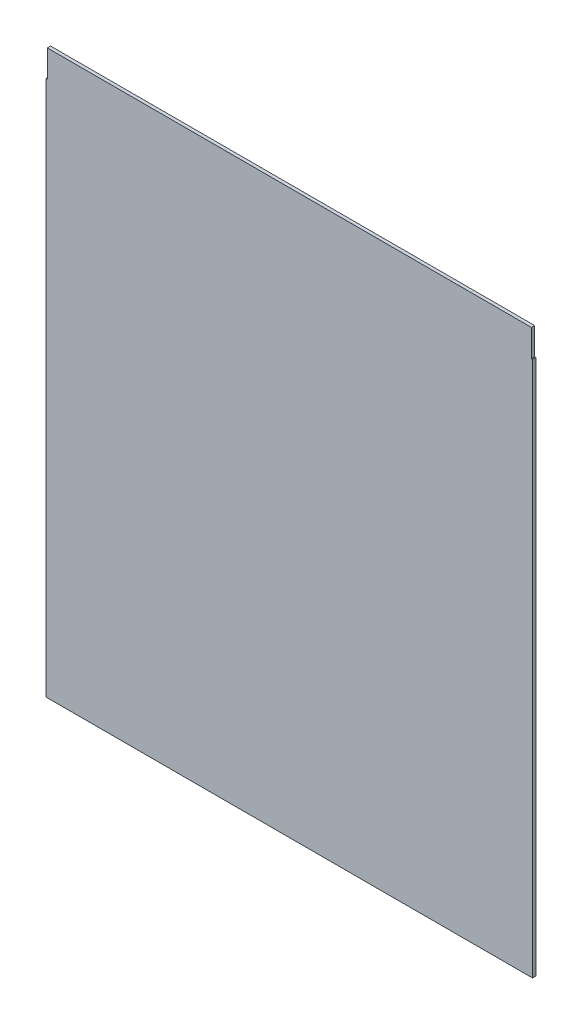
ISO-10303-21;
HEADER;
FILE_DESCRIPTION(('STEP AP214'),'2;1');
FILE_NAME('part.step','',(''),(''),'','','');
FILE_SCHEMA(('AUTOMOTIVE_DESIGN { 1 0 10303 214 1 1 1 1 }'));
ENDSEC;
DATA;
#1=APPLICATION_CONTEXT('core data for automotive mechanical design processes');
#2=APPLICATION_PROTOCOL_DEFINITION('international standard','automotive_design',2000,#1);
#3=PRODUCT_CONTEXT('',#1,'mechanical');
#4=PRODUCT('Part','Part','',(#3));
#5=PRODUCT_RELATED_PRODUCT_CATEGORY('part','',(#4));
#6=PRODUCT_DEFINITION_FORMATION('','',#4);
#7=PRODUCT_DEFINITION_CONTEXT('part definition',#1,'design');
#8=PRODUCT_DEFINITION('design','',#6,#7);
#9=PRODUCT_DEFINITION_SHAPE('','',#8);
#10=(LENGTH_UNIT() NAMED_UNIT(*) SI_UNIT(.MILLI.,.METRE.));
#11=(NAMED_UNIT(*) PLANE_ANGLE_UNIT() SI_UNIT($,.RADIAN.));
#12=(NAMED_UNIT(*) SI_UNIT($,.STERADIAN.) SOLID_ANGLE_UNIT());
#13=UNCERTAINTY_MEASURE_WITH_UNIT(LENGTH_MEASURE(1.E-05),#10,'distance_accuracy_value','');
#14=(GEOMETRIC_REPRESENTATION_CONTEXT(3) GLOBAL_UNCERTAINTY_ASSIGNED_CONTEXT((#13)) GLOBAL_UNIT_ASSIGNED_CONTEXT((#10,
#11,#12)) REPRESENTATION_CONTEXT('',''));
#15=CARTESIAN_POINT('',(0.,0.,0.));
#16=DIRECTION('',(0.,0.,1.));
#17=DIRECTION('',(1.,0.,0.));
#18=AXIS2_PLACEMENT_3D('',#15,#16,#17);
#19=CARTESIAN_POINT('',(187.161325966851,323.703267525864,3.));
#20=DIRECTION('',(-1.,0.,0.));
#21=DIRECTION('',(0.,0.,1.));
#22=AXIS2_PLACEMENT_3D('',#19,#20,#21);
#23=PLANE('',#22);
#24=DIRECTION('',(0.,1.,0.));
#25=VECTOR('',#24,1.);
#26=CARTESIAN_POINT('',(187.161325966851,323.703267525864,0.));
#27=LINE('',#26,#25);
#28=CARTESIAN_POINT('',(187.161325966851,298.703267525864,0.));
#29=VERTEX_POINT('',#28);
#30=CARTESIAN_POINT('',(187.161325966851,323.703267525864,0.));
#31=VERTEX_POINT('',#30);
#32=EDGE_CURVE('E130',#29,#31,#27,.T.);
#33=ORIENTED_EDGE('',*,*,#32,.T.);
#34=DIRECTION('',(0.,0.,-1.));
#35=VECTOR('',#34,1.);
#36=CARTESIAN_POINT('',(187.161325966851,323.703267525864,3.));
#37=LINE('',#36,#35);
#38=CARTESIAN_POINT('',(187.161325966851,323.703267525864,3.));
#39=VERTEX_POINT('',#38);
#40=EDGE_CURVE('E11',#39,#31,#37,.T.);
#41=ORIENTED_EDGE('',*,*,#40,.F.);
#42=DIRECTION('',(0.,1.,0.));
#43=VECTOR('',#42,1.);
#44=CARTESIAN_POINT('',(187.161325966851,323.703267525864,3.));
#45=LINE('',#44,#43);
#46=CARTESIAN_POINT('',(187.161325966851,298.703267525864,3.));
#47=VERTEX_POINT('',#46);
#48=EDGE_CURVE('E144',#47,#39,#45,.T.);
#49=ORIENTED_EDGE('',*,*,#48,.F.);
#50=DIRECTION('',(0.,0.,-1.));
#51=VECTOR('',#50,1.);
#52=CARTESIAN_POINT('',(187.161325966851,298.703267525864,3.));
#53=LINE('',#52,#51);
#54=EDGE_CURVE('E126',#47,#29,#53,.T.);
#55=ORIENTED_EDGE('',*,*,#54,.T.);
#56=EDGE_LOOP('',(#33,#41,#49,#55));
#57=FACE_BOUND('',#56,.T.);
#58=ADVANCED_FACE('F34',(#57),#23,.F.);
#59=CARTESIAN_POINT('',(-260.838674033149,323.703267525864,3.));
#60=DIRECTION('',(0.,-1.,0.));
#61=DIRECTION('',(0.,0.,-1.));
#62=AXIS2_PLACEMENT_3D('',#59,#60,#61);
#63=PLANE('',#62);
#64=DIRECTION('',(-1.,0.,0.));
#65=VECTOR('',#64,1.);
#66=CARTESIAN_POINT('',(-260.838674033149,323.703267525864,0.));
#67=LINE('',#66,#65);
#68=CARTESIAN_POINT('',(-260.838674033149,323.703267525864,0.));
#69=VERTEX_POINT('',#68);
#70=EDGE_CURVE('E133',#31,#69,#67,.T.);
#71=ORIENTED_EDGE('',*,*,#70,.T.);
#72=DIRECTION('',(0.,0.,-1.));
#73=VECTOR('',#72,1.);
#74=CARTESIAN_POINT('',(-260.838674033149,323.703267525864,3.));
#75=LINE('',#74,#73);
#76=CARTESIAN_POINT('',(-260.838674033149,323.703267525864,3.));
#77=VERTEX_POINT('',#76);
#78=EDGE_CURVE('E42',#77,#69,#75,.T.);
#79=ORIENTED_EDGE('',*,*,#78,.F.);
#80=DIRECTION('',(-1.,0.,0.));
#81=VECTOR('',#80,1.);
#82=CARTESIAN_POINT('',(-260.838674033149,323.703267525864,3.));
#83=LINE('',#82,#81);
#84=EDGE_CURVE('E93',#39,#77,#83,.T.);
#85=ORIENTED_EDGE('',*,*,#84,.F.);
#86=ORIENTED_EDGE('',*,*,#40,.T.);
#87=EDGE_LOOP('',(#71,#79,#85,#86));
#88=FACE_BOUND('',#87,.T.);
#89=ADVANCED_FACE('F179',(#88),#63,.F.);
#90=CARTESIAN_POINT('',(-260.838674033149,298.703267525864,3.));
#91=DIRECTION('',(1.,0.,0.));
#92=DIRECTION('',(0.,0.,-1.));
#93=AXIS2_PLACEMENT_3D('',#90,#91,#92);
#94=PLANE('',#93);
#95=DIRECTION('',(0.,-1.,0.));
#96=VECTOR('',#95,1.);
#97=CARTESIAN_POINT('',(-260.838674033149,298.703267525864,0.));
#98=LINE('',#97,#96);
#99=CARTESIAN_POINT('',(-260.838674033149,298.703267525864,0.));
#100=VERTEX_POINT('',#99);
#101=EDGE_CURVE('E135',#69,#100,#98,.T.);
#102=ORIENTED_EDGE('',*,*,#101,.T.);
#103=DIRECTION('',(0.,0.,-1.));
#104=VECTOR('',#103,1.);
#105=CARTESIAN_POINT('',(-260.838674033149,298.703267525864,3.));
#106=LINE('',#105,#104);
#107=CARTESIAN_POINT('',(-260.838674033149,298.703267525864,3.));
#108=VERTEX_POINT('',#107);
#109=EDGE_CURVE('E151',#108,#100,#106,.T.);
#110=ORIENTED_EDGE('',*,*,#109,.F.);
#111=DIRECTION('',(0.,-1.,0.));
#112=VECTOR('',#111,1.);
#113=CARTESIAN_POINT('',(-260.838674033149,298.703267525864,3.));
#114=LINE('',#113,#112);
#115=EDGE_CURVE('E159',#77,#108,#114,.T.);
#116=ORIENTED_EDGE('',*,*,#115,.F.);
#117=ORIENTED_EDGE('',*,*,#78,.T.);
#118=EDGE_LOOP('',(#102,#110,#116,#117));
#119=FACE_BOUND('',#118,.T.);
#120=ADVANCED_FACE('F157',(#119),#94,.F.);
#121=CARTESIAN_POINT('',(-261.838674033149,298.703267525864,3.));
#122=DIRECTION('',(0.,-1.,0.));
#123=DIRECTION('',(0.,0.,-1.));
#124=AXIS2_PLACEMENT_3D('',#121,#122,#123);
#125=PLANE('',#124);
#126=DIRECTION('',(-1.,0.,0.));
#127=VECTOR('',#126,1.);
#128=CARTESIAN_POINT('',(-261.838674033149,298.703267525864,0.));
#129=LINE('',#128,#127);
#130=CARTESIAN_POINT('',(-261.838674033149,298.703267525864,0.));
#131=VERTEX_POINT('',#130);
#132=EDGE_CURVE('E137',#100,#131,#129,.T.);
#133=ORIENTED_EDGE('',*,*,#132,.T.);
#134=DIRECTION('',(0.,0.,-1.));
#135=VECTOR('',#134,1.);
#136=CARTESIAN_POINT('',(-261.838674033149,298.703267525864,3.));
#137=LINE('',#136,#135);
#138=CARTESIAN_POINT('',(-261.838674033149,298.703267525864,3.));
#139=VERTEX_POINT('',#138);
#140=EDGE_CURVE('E148',#139,#131,#137,.T.);
#141=ORIENTED_EDGE('',*,*,#140,.F.);
#142=DIRECTION('',(-1.,0.,0.));
#143=VECTOR('',#142,1.);
#144=CARTESIAN_POINT('',(-261.838674033149,298.703267525864,3.));
#145=LINE('',#144,#143);
#146=EDGE_CURVE('E171',#108,#139,#145,.T.);
#147=ORIENTED_EDGE('',*,*,#146,.F.);
#148=ORIENTED_EDGE('',*,*,#109,.T.);
#149=EDGE_LOOP('',(#133,#141,#147,#148));
#150=FACE_BOUND('',#149,.T.);
#151=ADVANCED_FACE('F167',(#150),#125,.F.);
#152=CARTESIAN_POINT('',(-261.838674033149,298.703267525864,3.));
#153=DIRECTION('',(1.,0.,0.));
#154=DIRECTION('',(0.,1.,0.));
#155=AXIS2_PLACEMENT_3D('',#152,#153,#154);
#156=PLANE('',#155);
#157=DIRECTION('',(0.,-1.,0.));
#158=VECTOR('',#157,1.);
#159=CARTESIAN_POINT('',(-261.838674033149,298.703267525864,0.));
#160=LINE('',#159,#158);
#161=CARTESIAN_POINT('',(-261.838674033149,-197.096732474136,0.));
#162=VERTEX_POINT('',#161);
#163=EDGE_CURVE('E139',#131,#162,#160,.T.);
#164=ORIENTED_EDGE('',*,*,#163,.T.);
#165=DIRECTION('',(0.,0.,-1.));
#166=VECTOR('',#165,1.);
#167=CARTESIAN_POINT('',(-261.838674033149,-197.096732474136,3.));
#168=LINE('',#167,#166);
#169=CARTESIAN_POINT('',(-261.838674033149,-197.096732474136,3.));
#170=VERTEX_POINT('',#169);
#171=EDGE_CURVE('E121',#170,#162,#168,.T.);
#172=ORIENTED_EDGE('',*,*,#171,.F.);
#173=DIRECTION('',(0.,-1.,0.));
#174=VECTOR('',#173,1.);
#175=CARTESIAN_POINT('',(-261.838674033149,298.703267525864,3.));
#176=LINE('',#175,#174);
#177=EDGE_CURVE('E112',#139,#170,#176,.T.);
#178=ORIENTED_EDGE('',*,*,#177,.F.);
#179=ORIENTED_EDGE('',*,*,#140,.T.);
#180=EDGE_LOOP('',(#164,#172,#178,#179));
#181=FACE_BOUND('',#180,.T.);
#182=ADVANCED_FACE('F170',(#181),#156,.F.);
#183=CARTESIAN_POINT('',(-261.838674033149,-197.096732474136,3.));
#184=DIRECTION('',(0.,1.,0.));
#185=DIRECTION('',(0.,0.,1.));
#186=AXIS2_PLACEMENT_3D('',#183,#184,#185);
#187=PLANE('',#186);
#188=DIRECTION('',(1.,0.,0.));
#189=VECTOR('',#188,1.);
#190=CARTESIAN_POINT('',(-261.838674033149,-197.096732474136,0.));
#191=LINE('',#190,#189);
#192=CARTESIAN_POINT('',(188.161325966851,-197.096732474136,0.));
#193=VERTEX_POINT('',#192);
#194=EDGE_CURVE('E120',#162,#193,#191,.T.);
#195=ORIENTED_EDGE('',*,*,#194,.T.);
#196=DIRECTION('',(0.,0.,-1.));
#197=VECTOR('',#196,1.);
#198=CARTESIAN_POINT('',(188.161325966851,-197.096732474136,3.));
#199=LINE('',#198,#197);
#200=CARTESIAN_POINT('',(188.161325966851,-197.096732474136,3.));
#201=VERTEX_POINT('',#200);
#202=EDGE_CURVE('E117',#201,#193,#199,.T.);
#203=ORIENTED_EDGE('',*,*,#202,.F.);
#204=DIRECTION('',(1.,0.,0.));
#205=VECTOR('',#204,1.);
#206=CARTESIAN_POINT('',(-261.838674033149,-197.096732474136,3.));
#207=LINE('',#206,#205);
#208=EDGE_CURVE('E106',#170,#201,#207,.T.);
#209=ORIENTED_EDGE('',*,*,#208,.F.);
#210=ORIENTED_EDGE('',*,*,#171,.T.);
#211=EDGE_LOOP('',(#195,#203,#209,#210));
#212=FACE_BOUND('',#211,.T.);
#213=ADVANCED_FACE('F118',(#212),#187,.F.);
#214=CARTESIAN_POINT('',(188.161325966851,298.703267525864,3.));
#215=DIRECTION('',(-1.,0.,0.));
#216=DIRECTION('',(0.,-1.,0.));
#217=AXIS2_PLACEMENT_3D('',#214,#215,#216);
#218=PLANE('',#217);
#219=DIRECTION('',(0.,1.,0.));
#220=VECTOR('',#219,1.);
#221=CARTESIAN_POINT('',(188.161325966851,298.703267525864,0.));
#222=LINE('',#221,#220);
#223=CARTESIAN_POINT('',(188.161325966851,298.703267525864,0.));
#224=VERTEX_POINT('',#223);
#225=EDGE_CURVE('E79',#193,#224,#222,.T.);
#226=ORIENTED_EDGE('',*,*,#225,.T.);
#227=DIRECTION('',(0.,0.,-1.));
#228=VECTOR('',#227,1.);
#229=CARTESIAN_POINT('',(188.161325966851,298.703267525864,3.));
#230=LINE('',#229,#228);
#231=CARTESIAN_POINT('',(188.161325966851,298.703267525864,3.));
#232=VERTEX_POINT('',#231);
#233=EDGE_CURVE('E122',#232,#224,#230,.T.);
#234=ORIENTED_EDGE('',*,*,#233,.F.);
#235=DIRECTION('',(0.,1.,0.));
#236=VECTOR('',#235,1.);
#237=CARTESIAN_POINT('',(188.161325966851,298.703267525864,3.));
#238=LINE('',#237,#236);
#239=EDGE_CURVE('E110',#201,#232,#238,.T.);
#240=ORIENTED_EDGE('',*,*,#239,.F.);
#241=ORIENTED_EDGE('',*,*,#202,.T.);
#242=EDGE_LOOP('',(#226,#234,#240,#241));
#243=FACE_BOUND('',#242,.T.);
#244=ADVANCED_FACE('F124',(#243),#218,.F.);
#245=CARTESIAN_POINT('',(187.161325966851,298.703267525864,3.));
#246=DIRECTION('',(0.,-1.,0.));
#247=DIRECTION('',(0.,0.,-1.));
#248=AXIS2_PLACEMENT_3D('',#245,#246,#247);
#249=PLANE('',#248);
#250=DIRECTION('',(-1.,0.,0.));
#251=VECTOR('',#250,1.);
#252=CARTESIAN_POINT('',(187.161325966851,298.703267525864,0.));
#253=LINE('',#252,#251);
#254=EDGE_CURVE('E85',#224,#29,#253,.T.);
#255=ORIENTED_EDGE('',*,*,#254,.T.);
#256=ORIENTED_EDGE('',*,*,#54,.F.);
#257=DIRECTION('',(-1.,0.,0.));
#258=VECTOR('',#257,1.);
#259=CARTESIAN_POINT('',(187.161325966851,298.703267525864,3.));
#260=LINE('',#259,#258);
#261=EDGE_CURVE('E50',#232,#47,#260,.T.);
#262=ORIENTED_EDGE('',*,*,#261,.F.);
#263=ORIENTED_EDGE('',*,*,#233,.T.);
#264=EDGE_LOOP('',(#255,#256,#262,#263));
#265=FACE_BOUND('',#264,.T.);
#266=ADVANCED_FACE('F195',(#265),#249,.F.);
#267=CARTESIAN_POINT('',(0.,0.,3.));
#268=DIRECTION('',(0.,0.,1.));
#269=DIRECTION('',(1.,0.,0.));
#270=AXIS2_PLACEMENT_3D('',#267,#268,#269);
#271=PLANE('',#270);
#272=ORIENTED_EDGE('',*,*,#48,.T.);
#273=ORIENTED_EDGE('',*,*,#84,.T.);
#274=ORIENTED_EDGE('',*,*,#115,.T.);
#275=ORIENTED_EDGE('',*,*,#146,.T.);
#276=ORIENTED_EDGE('',*,*,#177,.T.);
#277=ORIENTED_EDGE('',*,*,#208,.T.);
#278=ORIENTED_EDGE('',*,*,#239,.T.);
#279=ORIENTED_EDGE('',*,*,#261,.T.);
#280=EDGE_LOOP('',(#272,#273,#274,#275,#276,#277,#278,#279));
#281=FACE_BOUND('',#280,.T.);
#282=ADVANCED_FACE('F108',(#281),#271,.T.);
#283=CARTESIAN_POINT('',(0.,0.,0.));
#284=DIRECTION('',(0.,0.,1.));
#285=DIRECTION('',(1.,0.,0.));
#286=AXIS2_PLACEMENT_3D('',#283,#284,#285);
#287=PLANE('',#286);
#288=ORIENTED_EDGE('',*,*,#32,.F.);
#289=ORIENTED_EDGE('',*,*,#254,.F.);
#290=ORIENTED_EDGE('',*,*,#225,.F.);
#291=ORIENTED_EDGE('',*,*,#194,.F.);
#292=ORIENTED_EDGE('',*,*,#163,.F.);
#293=ORIENTED_EDGE('',*,*,#132,.F.);
#294=ORIENTED_EDGE('',*,*,#101,.F.);
#295=ORIENTED_EDGE('',*,*,#70,.F.);
#296=EDGE_LOOP('',(#288,#289,#290,#291,#292,#293,#294,#295));
#297=FACE_BOUND('',#296,.T.);
#298=ADVANCED_FACE('F163',(#297),#287,.F.);
#299=CLOSED_SHELL('',(#58,#89,#120,#151,#182,#213,#244,#266,#282,#298));
#300=MANIFOLD_SOLID_BREP('B2',#299);
#301=ADVANCED_BREP_SHAPE_REPRESENTATION('',(#18,#300),#14);
#302=SHAPE_DEFINITION_REPRESENTATION(#9,#301);
ENDSEC;
END-ISO-10303-21;
